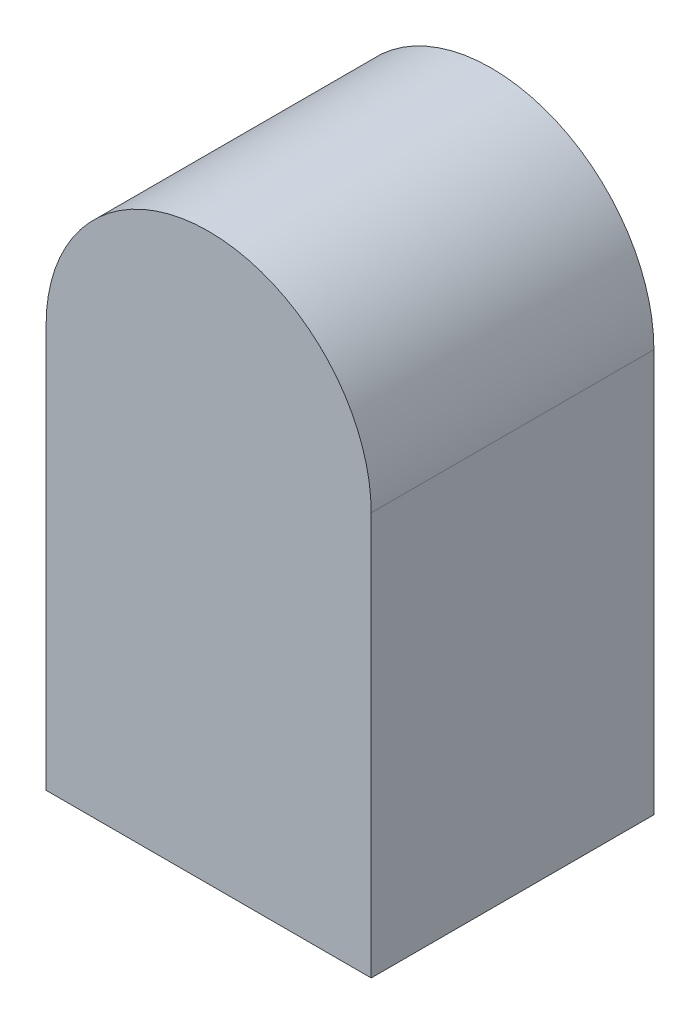
ISO-10303-21;
HEADER;
FILE_DESCRIPTION(('STEP AP214'),'2;1');
FILE_NAME('part.step','',(''),(''),'','','');
FILE_SCHEMA(('AUTOMOTIVE_DESIGN { 1 0 10303 214 1 1 1 1 }'));
ENDSEC;
DATA;
#1=APPLICATION_CONTEXT('core data for automotive mechanical design processes');
#2=APPLICATION_PROTOCOL_DEFINITION('international standard','automotive_design',2000,#1);
#3=PRODUCT_CONTEXT('',#1,'mechanical');
#4=PRODUCT('Part','Part','',(#3));
#5=PRODUCT_RELATED_PRODUCT_CATEGORY('part','',(#4));
#6=PRODUCT_DEFINITION_FORMATION('','',#4);
#7=PRODUCT_DEFINITION_CONTEXT('part definition',#1,'design');
#8=PRODUCT_DEFINITION('design','',#6,#7);
#9=PRODUCT_DEFINITION_SHAPE('','',#8);
#10=(LENGTH_UNIT() NAMED_UNIT(*) SI_UNIT(.MILLI.,.METRE.));
#11=(NAMED_UNIT(*) PLANE_ANGLE_UNIT() SI_UNIT($,.RADIAN.));
#12=(NAMED_UNIT(*) SI_UNIT($,.STERADIAN.) SOLID_ANGLE_UNIT());
#13=UNCERTAINTY_MEASURE_WITH_UNIT(LENGTH_MEASURE(1.E-05),#10,'distance_accuracy_value','');
#14=(GEOMETRIC_REPRESENTATION_CONTEXT(3) GLOBAL_UNCERTAINTY_ASSIGNED_CONTEXT((#13)) GLOBAL_UNIT_ASSIGNED_CONTEXT((#10,
#11,#12)) REPRESENTATION_CONTEXT('',''));
#15=CARTESIAN_POINT('',(0.,0.,0.));
#16=DIRECTION('',(0.,0.,1.));
#17=DIRECTION('',(1.,0.,0.));
#18=AXIS2_PLACEMENT_3D('',#15,#16,#17);
#19=CARTESIAN_POINT('',(1.25,-2.8335265642716,0.));
#20=DIRECTION('',(0.,0.,1.));
#21=DIRECTION('',(0.,1.,0.));
#22=AXIS2_PLACEMENT_3D('',#19,#20,#21);
#23=PLANE('',#22);
#24=DIRECTION('',(1.,0.,0.));
#25=VECTOR('',#24,1.);
#26=CARTESIAN_POINT('',(1.135,-3.,0.));
#27=LINE('',#26,#25);
#28=CARTESIAN_POINT('',(1.135,-3.,0.));
#29=VERTEX_POINT('',#28);
#30=CARTESIAN_POINT('',(1.365,-3.,0.));
#31=VERTEX_POINT('',#30);
#32=EDGE_CURVE('E11',#29,#31,#27,.T.);
#33=ORIENTED_EDGE('',*,*,#32,.F.);
#34=DIRECTION('',(0.,-1.,0.));
#35=VECTOR('',#34,1.);
#36=CARTESIAN_POINT('',(1.135,-2.715,0.));
#37=LINE('',#36,#35);
#38=CARTESIAN_POINT('',(1.135,-2.715,0.));
#39=VERTEX_POINT('',#38);
#40=EDGE_CURVE('E24',#39,#29,#37,.T.);
#41=ORIENTED_EDGE('',*,*,#40,.F.);
#42=CARTESIAN_POINT('',(1.25,-2.715,0.));
#43=DIRECTION('',(0.,0.,1.));
#44=DIRECTION('',(1.,0.,0.));
#45=AXIS2_PLACEMENT_3D('',#42,#43,#44);
#46=CIRCLE('',#45,0.115);
#47=CARTESIAN_POINT('',(1.365,-2.715,0.));
#48=VERTEX_POINT('',#47);
#49=EDGE_CURVE('E85',#48,#39,#46,.T.);
#50=ORIENTED_EDGE('',*,*,#49,.F.);
#51=DIRECTION('',(0.,1.,0.));
#52=VECTOR('',#51,1.);
#53=CARTESIAN_POINT('',(1.365,-3.,0.));
#54=LINE('',#53,#52);
#55=EDGE_CURVE('E82',#31,#48,#54,.T.);
#56=ORIENTED_EDGE('',*,*,#55,.F.);
#57=EDGE_LOOP('',(#33,#41,#50,#56));
#58=FACE_BOUND('',#57,.T.);
#59=ADVANCED_FACE('F17',(#58),#23,.F.);
#60=CARTESIAN_POINT('',(1.365,-3.,0.));
#61=DIRECTION('',(1.,0.,0.));
#62=DIRECTION('',(0.,1.,0.));
#63=AXIS2_PLACEMENT_3D('',#60,#61,#62);
#64=PLANE('',#63);
#65=ORIENTED_EDGE('',*,*,#55,.T.);
#66=DIRECTION('',(0.,0.,1.));
#67=VECTOR('',#66,1.);
#68=CARTESIAN_POINT('',(1.365,-2.715,0.));
#69=LINE('',#68,#67);
#70=CARTESIAN_POINT('',(1.365,-2.715,0.2));
#71=VERTEX_POINT('',#70);
#72=EDGE_CURVE('E80',#48,#71,#69,.T.);
#73=ORIENTED_EDGE('',*,*,#72,.T.);
#74=DIRECTION('',(0.,1.,0.));
#75=VECTOR('',#74,1.);
#76=CARTESIAN_POINT('',(1.365,-3.,0.2));
#77=LINE('',#76,#75);
#78=CARTESIAN_POINT('',(1.365,-3.,0.2));
#79=VERTEX_POINT('',#78);
#80=EDGE_CURVE('E78',#79,#71,#77,.T.);
#81=ORIENTED_EDGE('',*,*,#80,.F.);
#82=DIRECTION('',(0.,0.,-1.));
#83=VECTOR('',#82,1.);
#84=CARTESIAN_POINT('',(1.365,-3.,0.));
#85=LINE('',#84,#83);
#86=EDGE_CURVE('E71',#79,#31,#85,.T.);
#87=ORIENTED_EDGE('',*,*,#86,.T.);
#88=EDGE_LOOP('',(#65,#73,#81,#87));
#89=FACE_BOUND('',#88,.T.);
#90=ADVANCED_FACE('F91',(#89),#64,.T.);
#91=CARTESIAN_POINT('',(1.25,-2.715,0.));
#92=DIRECTION('',(0.,0.,1.));
#93=DIRECTION('',(1.,0.,0.));
#94=AXIS2_PLACEMENT_3D('',#91,#92,#93);
#95=CYLINDRICAL_SURFACE('',#94,0.115);
#96=ORIENTED_EDGE('',*,*,#49,.T.);
#97=DIRECTION('',(0.,0.,1.));
#98=VECTOR('',#97,1.);
#99=CARTESIAN_POINT('',(1.135,-2.715,0.));
#100=LINE('',#99,#98);
#101=CARTESIAN_POINT('',(1.135,-2.715,0.2));
#102=VERTEX_POINT('',#101);
#103=EDGE_CURVE('E75',#39,#102,#100,.T.);
#104=ORIENTED_EDGE('',*,*,#103,.T.);
#105=CARTESIAN_POINT('',(1.25,-2.715,0.2));
#106=DIRECTION('',(0.,0.,1.));
#107=DIRECTION('',(1.,0.,0.));
#108=AXIS2_PLACEMENT_3D('',#105,#106,#107);
#109=CIRCLE('',#108,0.115);
#110=EDGE_CURVE('E59',#71,#102,#109,.T.);
#111=ORIENTED_EDGE('',*,*,#110,.F.);
#112=ORIENTED_EDGE('',*,*,#72,.F.);
#113=EDGE_LOOP('',(#96,#104,#111,#112));
#114=FACE_BOUND('',#113,.T.);
#115=ADVANCED_FACE('F89',(#114),#95,.T.);
#116=CARTESIAN_POINT('',(1.135,-2.715,0.));
#117=DIRECTION('',(-1.,0.,0.));
#118=DIRECTION('',(0.,-1.,0.));
#119=AXIS2_PLACEMENT_3D('',#116,#117,#118);
#120=PLANE('',#119);
#121=ORIENTED_EDGE('',*,*,#40,.T.);
#122=DIRECTION('',(0.,0.,1.));
#123=VECTOR('',#122,1.);
#124=CARTESIAN_POINT('',(1.135,-3.,0.));
#125=LINE('',#124,#123);
#126=CARTESIAN_POINT('',(1.135,-3.,0.2));
#127=VERTEX_POINT('',#126);
#128=EDGE_CURVE('E53',#29,#127,#125,.T.);
#129=ORIENTED_EDGE('',*,*,#128,.T.);
#130=DIRECTION('',(0.,-1.,0.));
#131=VECTOR('',#130,1.);
#132=CARTESIAN_POINT('',(1.135,-2.715,0.2));
#133=LINE('',#132,#131);
#134=EDGE_CURVE('E57',#102,#127,#133,.T.);
#135=ORIENTED_EDGE('',*,*,#134,.F.);
#136=ORIENTED_EDGE('',*,*,#103,.F.);
#137=EDGE_LOOP('',(#121,#129,#135,#136));
#138=FACE_BOUND('',#137,.T.);
#139=ADVANCED_FACE('F55',(#138),#120,.T.);
#140=CARTESIAN_POINT('',(-3.,-3.,0.));
#141=DIRECTION('',(0.,-1.,0.));
#142=DIRECTION('',(1.,0.,0.));
#143=AXIS2_PLACEMENT_3D('',#140,#141,#142);
#144=PLANE('',#143);
#145=ORIENTED_EDGE('',*,*,#86,.F.);
#146=DIRECTION('',(1.,0.,0.));
#147=VECTOR('',#146,1.);
#148=CARTESIAN_POINT('',(-0.875,-3.,0.2));
#149=LINE('',#148,#147);
#150=EDGE_CURVE('E66',#127,#79,#149,.T.);
#151=ORIENTED_EDGE('',*,*,#150,.F.);
#152=ORIENTED_EDGE('',*,*,#128,.F.);
#153=ORIENTED_EDGE('',*,*,#32,.T.);
#154=EDGE_LOOP('',(#145,#151,#152,#153));
#155=FACE_BOUND('',#154,.T.);
#156=ADVANCED_FACE('F69',(#155),#144,.T.);
#157=CARTESIAN_POINT('',(1.25,-2.8335240809167,0.2));
#158=DIRECTION('',(0.,0.,1.));
#159=DIRECTION('',(1.,0.,0.));
#160=AXIS2_PLACEMENT_3D('',#157,#158,#159);
#161=PLANE('',#160);
#162=ORIENTED_EDGE('',*,*,#134,.T.);
#163=ORIENTED_EDGE('',*,*,#150,.T.);
#164=ORIENTED_EDGE('',*,*,#80,.T.);
#165=ORIENTED_EDGE('',*,*,#110,.T.);
#166=EDGE_LOOP('',(#162,#163,#164,#165));
#167=FACE_BOUND('',#166,.T.);
#168=ADVANCED_FACE('F64',(#167),#161,.T.);
#169=CLOSED_SHELL('',(#59,#90,#115,#139,#156,#168));
#170=MANIFOLD_SOLID_BREP('B1',#169);
#171=ADVANCED_BREP_SHAPE_REPRESENTATION('',(#18,#170),#14);
#172=SHAPE_DEFINITION_REPRESENTATION(#9,#171);
ENDSEC;
END-ISO-10303-21;
